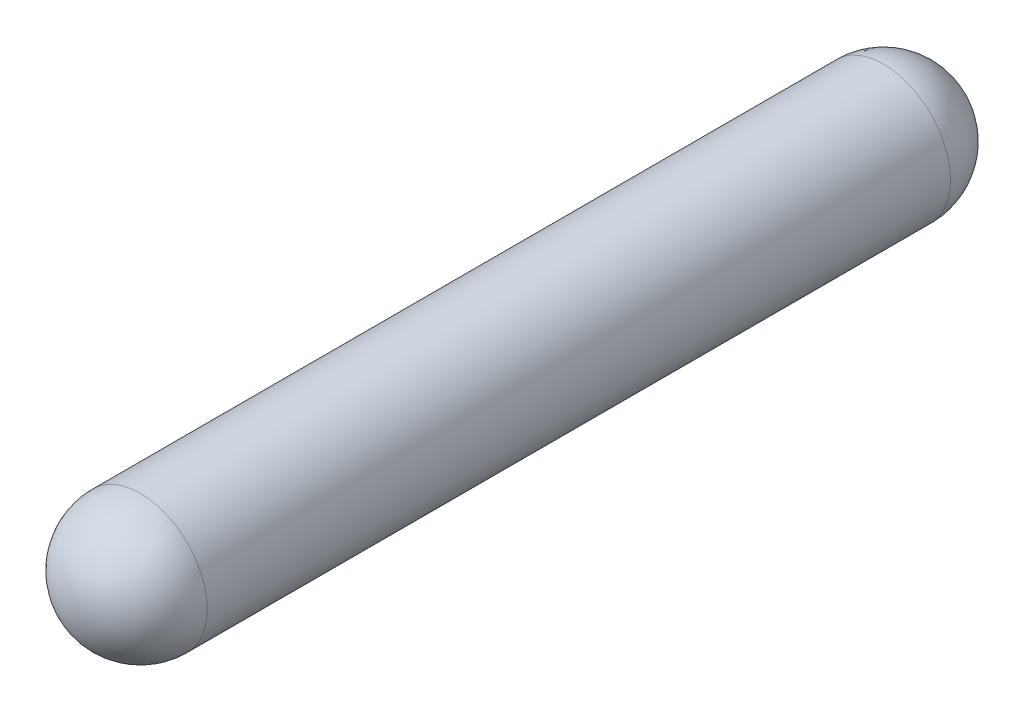
ISO-10303-21;
HEADER;
FILE_DESCRIPTION(('STEP AP214'),'2;1');
FILE_NAME('part.step','',(''),(''),'','','');
FILE_SCHEMA(('AUTOMOTIVE_DESIGN { 1 0 10303 214 1 1 1 1 }'));
ENDSEC;
DATA;
#1=APPLICATION_CONTEXT('core data for automotive mechanical design processes');
#2=APPLICATION_PROTOCOL_DEFINITION('international standard','automotive_design',2000,#1);
#3=PRODUCT_CONTEXT('',#1,'mechanical');
#4=PRODUCT('Part','Part','',(#3));
#5=PRODUCT_RELATED_PRODUCT_CATEGORY('part','',(#4));
#6=PRODUCT_DEFINITION_FORMATION('','',#4);
#7=PRODUCT_DEFINITION_CONTEXT('part definition',#1,'design');
#8=PRODUCT_DEFINITION('design','',#6,#7);
#9=PRODUCT_DEFINITION_SHAPE('','',#8);
#10=(LENGTH_UNIT() NAMED_UNIT(*) SI_UNIT(.MILLI.,.METRE.));
#11=(NAMED_UNIT(*) PLANE_ANGLE_UNIT() SI_UNIT($,.RADIAN.));
#12=(NAMED_UNIT(*) SI_UNIT($,.STERADIAN.) SOLID_ANGLE_UNIT());
#13=UNCERTAINTY_MEASURE_WITH_UNIT(LENGTH_MEASURE(1.E-05),#10,'distance_accuracy_value','');
#14=(GEOMETRIC_REPRESENTATION_CONTEXT(3) GLOBAL_UNCERTAINTY_ASSIGNED_CONTEXT((#13)) GLOBAL_UNIT_ASSIGNED_CONTEXT((#10,
#11,#12)) REPRESENTATION_CONTEXT('',''));
#15=CARTESIAN_POINT('',(0.,0.,0.));
#16=DIRECTION('',(0.,0.,1.));
#17=DIRECTION('',(1.,0.,0.));
#18=AXIS2_PLACEMENT_3D('',#15,#16,#17);
#19=CARTESIAN_POINT('',(-6.,0.,-3.));
#20=DIRECTION('',(1.,0.,0.));
#21=DIRECTION('',(0.,-1.,0.));
#22=AXIS2_PLACEMENT_3D('',#19,#20,#21);
#23=SPHERICAL_SURFACE('',#22,0.585);
#24=CARTESIAN_POINT('',(-6.,0.,-3.));
#25=DIRECTION('',(0.,0.,1.));
#26=DIRECTION('',(1.,0.,0.));
#27=AXIS2_PLACEMENT_3D('',#24,#25,#26);
#28=CIRCLE('',#27,0.585);
#29=CARTESIAN_POINT('',(-5.415,0.,-3.));
#30=VERTEX_POINT('',#29);
#31=CARTESIAN_POINT('',(-6.585,0.,-3.));
#32=VERTEX_POINT('',#31);
#33=EDGE_CURVE('E42',#30,#32,#28,.T.);
#34=ORIENTED_EDGE('',*,*,#33,.F.);
#35=CARTESIAN_POINT('',(-6.,0.,-3.));
#36=DIRECTION('',(0.,0.,1.));
#37=DIRECTION('',(1.,0.,0.));
#38=AXIS2_PLACEMENT_3D('',#35,#36,#37);
#39=CIRCLE('',#38,0.585);
#40=EDGE_CURVE('E26',#32,#30,#39,.T.);
#41=ORIENTED_EDGE('',*,*,#40,.F.);
#42=EDGE_LOOP('',(#34,#41));
#43=FACE_BOUND('',#42,.T.);
#44=ADVANCED_FACE('F17',(#43),#23,.T.);
#45=CARTESIAN_POINT('',(-6.,0.,3.5));
#46=DIRECTION('',(1.,0.,0.));
#47=DIRECTION('',(0.,1.,0.));
#48=AXIS2_PLACEMENT_3D('',#45,#46,#47);
#49=SPHERICAL_SURFACE('',#48,0.585);
#50=CARTESIAN_POINT('',(-6.,0.,3.5));
#51=DIRECTION('',(0.,0.,1.));
#52=DIRECTION('',(1.,0.,0.));
#53=AXIS2_PLACEMENT_3D('',#50,#51,#52);
#54=CIRCLE('',#53,0.585);
#55=CARTESIAN_POINT('',(-5.415,0.,3.5));
#56=VERTEX_POINT('',#55);
#57=CARTESIAN_POINT('',(-6.585,0.,3.5));
#58=VERTEX_POINT('',#57);
#59=EDGE_CURVE('E11',#56,#58,#54,.F.);
#60=ORIENTED_EDGE('',*,*,#59,.F.);
#61=CARTESIAN_POINT('',(-6.,0.,3.5));
#62=DIRECTION('',(0.,0.,1.));
#63=DIRECTION('',(1.,0.,0.));
#64=AXIS2_PLACEMENT_3D('',#61,#62,#63);
#65=CIRCLE('',#64,0.585);
#66=EDGE_CURVE('E34',#58,#56,#65,.F.);
#67=ORIENTED_EDGE('',*,*,#66,.F.);
#68=EDGE_LOOP('',(#60,#67));
#69=FACE_BOUND('',#68,.T.);
#70=ADVANCED_FACE('F49',(#69),#49,.T.);
#71=CARTESIAN_POINT('',(-6.,0.,-3.));
#72=DIRECTION('',(0.,0.,1.));
#73=DIRECTION('',(1.,0.,0.));
#74=AXIS2_PLACEMENT_3D('',#71,#72,#73);
#75=CYLINDRICAL_SURFACE('',#74,0.585);
#76=ORIENTED_EDGE('',*,*,#66,.T.);
#77=ORIENTED_EDGE('',*,*,#59,.T.);
#78=EDGE_LOOP('',(#76,#77));
#79=FACE_BOUND('',#78,.T.);
#80=ORIENTED_EDGE('',*,*,#40,.T.);
#81=ORIENTED_EDGE('',*,*,#33,.T.);
#82=EDGE_LOOP('',(#80,#81));
#83=FACE_BOUND('',#82,.T.);
#84=ADVANCED_FACE('F45',(#79,#83),#75,.T.);
#85=CLOSED_SHELL('',(#44,#70,#84));
#86=MANIFOLD_SOLID_BREP('B1',#85);
#87=ADVANCED_BREP_SHAPE_REPRESENTATION('',(#18,#86),#14);
#88=SHAPE_DEFINITION_REPRESENTATION(#9,#87);
ENDSEC;
END-ISO-10303-21;
